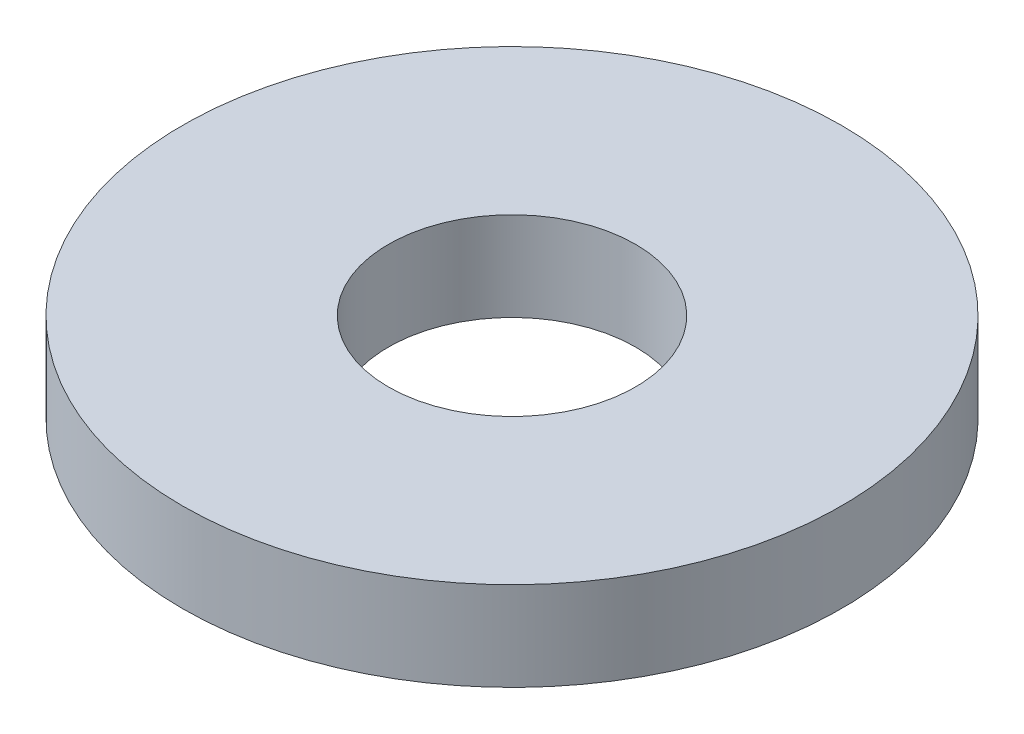
ISO-10303-21;
HEADER;
FILE_DESCRIPTION(('STEP AP214'),'2;1');
FILE_NAME('part.step','',(''),(''),'','','');
FILE_SCHEMA(('AUTOMOTIVE_DESIGN { 1 0 10303 214 1 1 1 1 }'));
ENDSEC;
DATA;
#1=APPLICATION_CONTEXT('core data for automotive mechanical design processes');
#2=APPLICATION_PROTOCOL_DEFINITION('international standard','automotive_design',2000,#1);
#3=PRODUCT_CONTEXT('',#1,'mechanical');
#4=PRODUCT('Part','Part','',(#3));
#5=PRODUCT_RELATED_PRODUCT_CATEGORY('part','',(#4));
#6=PRODUCT_DEFINITION_FORMATION('','',#4);
#7=PRODUCT_DEFINITION_CONTEXT('part definition',#1,'design');
#8=PRODUCT_DEFINITION('design','',#6,#7);
#9=PRODUCT_DEFINITION_SHAPE('','',#8);
#10=(LENGTH_UNIT() NAMED_UNIT(*) SI_UNIT(.MILLI.,.METRE.));
#11=(NAMED_UNIT(*) PLANE_ANGLE_UNIT() SI_UNIT($,.RADIAN.));
#12=(NAMED_UNIT(*) SI_UNIT($,.STERADIAN.) SOLID_ANGLE_UNIT());
#13=UNCERTAINTY_MEASURE_WITH_UNIT(LENGTH_MEASURE(1.E-05),#10,'distance_accuracy_value','');
#14=(GEOMETRIC_REPRESENTATION_CONTEXT(3) GLOBAL_UNCERTAINTY_ASSIGNED_CONTEXT((#13)) GLOBAL_UNIT_ASSIGNED_CONTEXT((#10,
#11,#12)) REPRESENTATION_CONTEXT('',''));
#15=CARTESIAN_POINT('',(0.,0.,0.));
#16=DIRECTION('',(0.,0.,1.));
#17=DIRECTION('',(1.,0.,0.));
#18=AXIS2_PLACEMENT_3D('',#15,#16,#17);
#19=CARTESIAN_POINT('',(0.,27.,0.));
#20=DIRECTION('',(0.,-1.,0.));
#21=DIRECTION('',(0.,0.,-1.));
#22=AXIS2_PLACEMENT_3D('',#19,#20,#21);
#23=CYLINDRICAL_SURFACE('',#22,100.);
#24=CARTESIAN_POINT('',(0.,27.,0.));
#25=DIRECTION('',(0.,1.,0.));
#26=DIRECTION('',(0.,0.,1.));
#27=AXIS2_PLACEMENT_3D('',#24,#25,#26);
#28=CIRCLE('',#27,100.);
#29=CARTESIAN_POINT('',(0.,27.,100.));
#30=VERTEX_POINT('',#29);
#31=EDGE_CURVE('E10',#30,#30,#28,.T.);
#32=ORIENTED_EDGE('',*,*,#31,.F.);
#33=EDGE_LOOP('',(#32));
#34=FACE_BOUND('',#33,.T.);
#35=CARTESIAN_POINT('',(0.,0.,0.));
#36=DIRECTION('',(0.,1.,0.));
#37=DIRECTION('',(0.,0.,1.));
#38=AXIS2_PLACEMENT_3D('',#35,#36,#37);
#39=CIRCLE('',#38,100.);
#40=CARTESIAN_POINT('',(0.,0.,100.));
#41=VERTEX_POINT('',#40);
#42=EDGE_CURVE('E37',#41,#41,#39,.T.);
#43=ORIENTED_EDGE('',*,*,#42,.T.);
#44=EDGE_LOOP('',(#43));
#45=FACE_BOUND('',#44,.T.);
#46=ADVANCED_FACE('F40',(#34,#45),#23,.T.);
#47=CARTESIAN_POINT('',(0.,27.,0.));
#48=DIRECTION('',(0.,1.,0.));
#49=DIRECTION('',(0.,0.,1.));
#50=AXIS2_PLACEMENT_3D('',#47,#48,#49);
#51=PLANE('',#50);
#52=CARTESIAN_POINT('',(0.,27.,0.));
#53=DIRECTION('',(0.,1.,0.));
#54=DIRECTION('',(0.,0.,1.));
#55=AXIS2_PLACEMENT_3D('',#52,#53,#54);
#56=CIRCLE('',#55,37.5);
#57=CARTESIAN_POINT('',(0.,27.,37.5));
#58=VERTEX_POINT('',#57);
#59=EDGE_CURVE('E50',#58,#58,#56,.T.);
#60=ORIENTED_EDGE('',*,*,#59,.F.);
#61=EDGE_LOOP('',(#60));
#62=FACE_BOUND('',#61,.T.);
#63=ORIENTED_EDGE('',*,*,#31,.T.);
#64=EDGE_LOOP('',(#63));
#65=FACE_BOUND('',#64,.T.);
#66=ADVANCED_FACE('F59',(#62,#65),#51,.T.);
#67=CARTESIAN_POINT('',(0.,0.,0.));
#68=DIRECTION('',(0.,1.,0.));
#69=DIRECTION('',(0.,0.,1.));
#70=AXIS2_PLACEMENT_3D('',#67,#68,#69);
#71=PLANE('',#70);
#72=CARTESIAN_POINT('',(0.,0.,0.));
#73=DIRECTION('',(0.,1.,0.));
#74=DIRECTION('',(0.,0.,1.));
#75=AXIS2_PLACEMENT_3D('',#72,#73,#74);
#76=CIRCLE('',#75,37.5);
#77=CARTESIAN_POINT('',(0.,0.,37.5));
#78=VERTEX_POINT('',#77);
#79=EDGE_CURVE('E47',#78,#78,#76,.T.);
#80=ORIENTED_EDGE('',*,*,#79,.T.);
#81=EDGE_LOOP('',(#80));
#82=FACE_BOUND('',#81,.T.);
#83=ORIENTED_EDGE('',*,*,#42,.F.);
#84=EDGE_LOOP('',(#83));
#85=FACE_BOUND('',#84,.T.);
#86=ADVANCED_FACE('F58',(#82,#85),#71,.F.);
#87=CARTESIAN_POINT('',(0.,27.,0.));
#88=DIRECTION('',(0.,-1.,0.));
#89=DIRECTION('',(0.,0.,-1.));
#90=AXIS2_PLACEMENT_3D('',#87,#88,#89);
#91=CYLINDRICAL_SURFACE('',#90,37.5);
#92=ORIENTED_EDGE('',*,*,#59,.T.);
#93=EDGE_LOOP('',(#92));
#94=FACE_BOUND('',#93,.T.);
#95=ORIENTED_EDGE('',*,*,#79,.F.);
#96=EDGE_LOOP('',(#95));
#97=FACE_BOUND('',#96,.T.);
#98=ADVANCED_FACE('F54',(#94,#97),#91,.F.);
#99=CLOSED_SHELL('',(#46,#66,#86,#98));
#100=MANIFOLD_SOLID_BREP('B2',#99);
#101=ADVANCED_BREP_SHAPE_REPRESENTATION('',(#18,#100),#14);
#102=SHAPE_DEFINITION_REPRESENTATION(#9,#101);
ENDSEC;
END-ISO-10303-21;
